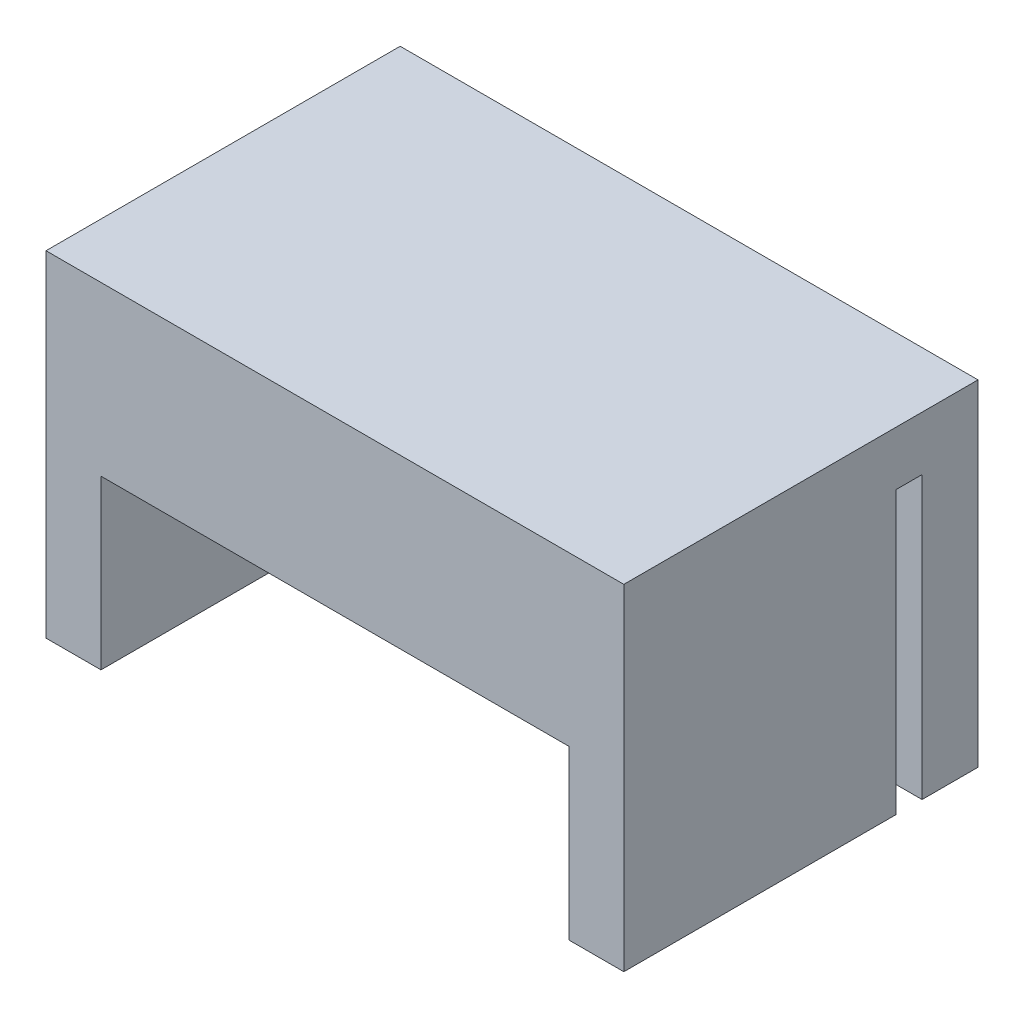
ISO-10303-21;
HEADER;
FILE_DESCRIPTION(('STEP AP214'),'2;1');
FILE_NAME('part.step','',(''),(''),'','','');
FILE_SCHEMA(('AUTOMOTIVE_DESIGN { 1 0 10303 214 1 1 1 1 }'));
ENDSEC;
DATA;
#1=APPLICATION_CONTEXT('core data for automotive mechanical design processes');
#2=APPLICATION_PROTOCOL_DEFINITION('international standard','automotive_design',2000,#1);
#3=PRODUCT_CONTEXT('',#1,'mechanical');
#4=PRODUCT('Part','Part','',(#3));
#5=PRODUCT_RELATED_PRODUCT_CATEGORY('part','',(#4));
#6=PRODUCT_DEFINITION_FORMATION('','',#4);
#7=PRODUCT_DEFINITION_CONTEXT('part definition',#1,'design');
#8=PRODUCT_DEFINITION('design','',#6,#7);
#9=PRODUCT_DEFINITION_SHAPE('','',#8);
#10=(LENGTH_UNIT() NAMED_UNIT(*) SI_UNIT(.MILLI.,.METRE.));
#11=(NAMED_UNIT(*) PLANE_ANGLE_UNIT() SI_UNIT($,.RADIAN.));
#12=(NAMED_UNIT(*) SI_UNIT($,.STERADIAN.) SOLID_ANGLE_UNIT());
#13=UNCERTAINTY_MEASURE_WITH_UNIT(LENGTH_MEASURE(1.E-05),#10,'distance_accuracy_value','');
#14=(GEOMETRIC_REPRESENTATION_CONTEXT(3) GLOBAL_UNCERTAINTY_ASSIGNED_CONTEXT((#13)) GLOBAL_UNIT_ASSIGNED_CONTEXT((#10,
#11,#12)) REPRESENTATION_CONTEXT('',''));
#15=CARTESIAN_POINT('',(0.,0.,0.));
#16=DIRECTION('',(0.,0.,1.));
#17=DIRECTION('',(1.,0.,0.));
#18=AXIS2_PLACEMENT_3D('',#15,#16,#17);
#19=CARTESIAN_POINT('',(-15.5,-9.,19.));
#20=DIRECTION('',(0.,1.,0.));
#21=DIRECTION('',(0.,0.,1.));
#22=AXIS2_PLACEMENT_3D('',#19,#20,#21);
#23=PLANE('',#22);
#24=DIRECTION('',(0.,0.,1.));
#25=VECTOR('',#24,1.);
#26=CARTESIAN_POINT('',(12.55,-9.,3.));
#27=LINE('',#26,#25);
#28=CARTESIAN_POINT('',(12.55,-9.,4.4));
#29=VERTEX_POINT('',#28);
#30=CARTESIAN_POINT('',(12.55,-9.,19.));
#31=VERTEX_POINT('',#30);
#32=EDGE_CURVE('E50',#29,#31,#27,.T.);
#33=ORIENTED_EDGE('',*,*,#32,.F.);
#34=DIRECTION('',(-1.,0.,0.));
#35=VECTOR('',#34,1.);
#36=CARTESIAN_POINT('',(-15.5,-9.,4.4));
#37=LINE('',#36,#35);
#38=CARTESIAN_POINT('',(15.5,-9.,4.4));
#39=VERTEX_POINT('',#38);
#40=EDGE_CURVE('E156',#39,#29,#37,.T.);
#41=ORIENTED_EDGE('',*,*,#40,.F.);
#42=DIRECTION('',(0.,0.,-1.));
#43=VECTOR('',#42,1.);
#44=CARTESIAN_POINT('',(15.5,-9.,19.));
#45=LINE('',#44,#43);
#46=CARTESIAN_POINT('',(15.5,-9.,19.));
#47=VERTEX_POINT('',#46);
#48=EDGE_CURVE('E207',#47,#39,#45,.T.);
#49=ORIENTED_EDGE('',*,*,#48,.F.);
#50=DIRECTION('',(1.,0.,0.));
#51=VECTOR('',#50,1.);
#52=CARTESIAN_POINT('',(-15.5,-9.,19.));
#53=LINE('',#52,#51);
#54=EDGE_CURVE('E58',#31,#47,#53,.T.);
#55=ORIENTED_EDGE('',*,*,#54,.F.);
#56=EDGE_LOOP('',(#33,#41,#49,#55));
#57=FACE_BOUND('',#56,.T.);
#58=ADVANCED_FACE('F34',(#57),#23,.F.);
#59=DIRECTION('',(0.,0.,-1.));
#60=VECTOR('',#59,1.);
#61=CARTESIAN_POINT('',(-15.5,-9.,19.));
#62=LINE('',#61,#60);
#63=CARTESIAN_POINT('',(-15.5,-9.,19.));
#64=VERTEX_POINT('',#63);
#65=CARTESIAN_POINT('',(-15.5,-9.,4.4));
#66=VERTEX_POINT('',#65);
#67=EDGE_CURVE('E210',#64,#66,#62,.T.);
#68=ORIENTED_EDGE('',*,*,#67,.T.);
#69=CARTESIAN_POINT('',(-12.55,-9.,4.4));
#70=VERTEX_POINT('',#69);
#71=EDGE_CURVE('E218',#70,#66,#37,.T.);
#72=ORIENTED_EDGE('',*,*,#71,.F.);
#73=DIRECTION('',(0.,0.,1.));
#74=VECTOR('',#73,1.);
#75=CARTESIAN_POINT('',(-12.55,-9.,3.));
#76=LINE('',#75,#74);
#77=CARTESIAN_POINT('',(-12.55,-9.,19.));
#78=VERTEX_POINT('',#77);
#79=EDGE_CURVE('E177',#70,#78,#76,.T.);
#80=ORIENTED_EDGE('',*,*,#79,.T.);
#81=EDGE_CURVE('E198',#64,#78,#53,.T.);
#82=ORIENTED_EDGE('',*,*,#81,.F.);
#83=EDGE_LOOP('',(#68,#72,#80,#82));
#84=FACE_BOUND('',#83,.T.);
#85=ADVANCED_FACE('F247',(#84),#23,.F.);
#86=CARTESIAN_POINT('',(15.5,-9.,19.));
#87=DIRECTION('',(-1.,0.,0.));
#88=DIRECTION('',(0.,0.,1.));
#89=AXIS2_PLACEMENT_3D('',#86,#87,#88);
#90=PLANE('',#89);
#91=ORIENTED_EDGE('',*,*,#48,.T.);
#92=DIRECTION('',(0.,-1.,0.));
#93=VECTOR('',#92,1.);
#94=CARTESIAN_POINT('',(15.5,6.1,4.4));
#95=LINE('',#94,#93);
#96=CARTESIAN_POINT('',(15.5,6.1,4.4));
#97=VERTEX_POINT('',#96);
#98=EDGE_CURVE('E162',#97,#39,#95,.T.);
#99=ORIENTED_EDGE('',*,*,#98,.F.);
#100=DIRECTION('',(0.,0.,1.));
#101=VECTOR('',#100,1.);
#102=CARTESIAN_POINT('',(15.5,6.1,4.4));
#103=LINE('',#102,#101);
#104=CARTESIAN_POINT('',(15.5,6.1,3.));
#105=VERTEX_POINT('',#104);
#106=EDGE_CURVE('E146',#105,#97,#103,.T.);
#107=ORIENTED_EDGE('',*,*,#106,.F.);
#108=DIRECTION('',(0.,-1.,0.));
#109=VECTOR('',#108,1.);
#110=CARTESIAN_POINT('',(15.5,6.1,3.));
#111=LINE('',#110,#109);
#112=CARTESIAN_POINT('',(15.5,-9.,3.));
#113=VERTEX_POINT('',#112);
#114=EDGE_CURVE('E143',#105,#113,#111,.T.);
#115=ORIENTED_EDGE('',*,*,#114,.T.);
#116=CARTESIAN_POINT('',(15.5,-9.,0.));
#117=VERTEX_POINT('',#116);
#118=EDGE_CURVE('E81',#113,#117,#45,.T.);
#119=ORIENTED_EDGE('',*,*,#118,.T.);
#120=DIRECTION('',(0.,1.,0.));
#121=VECTOR('',#120,1.);
#122=CARTESIAN_POINT('',(15.5,-9.,0.));
#123=LINE('',#122,#121);
#124=CARTESIAN_POINT('',(15.5,9.,0.));
#125=VERTEX_POINT('',#124);
#126=EDGE_CURVE('E187',#117,#125,#123,.T.);
#127=ORIENTED_EDGE('',*,*,#126,.T.);
#128=DIRECTION('',(0.,0.,-1.));
#129=VECTOR('',#128,1.);
#130=CARTESIAN_POINT('',(15.5,9.,19.));
#131=LINE('',#130,#129);
#132=CARTESIAN_POINT('',(15.5,9.,19.));
#133=VERTEX_POINT('',#132);
#134=EDGE_CURVE('E43',#133,#125,#131,.T.);
#135=ORIENTED_EDGE('',*,*,#134,.F.);
#136=DIRECTION('',(0.,1.,0.));
#137=VECTOR('',#136,1.);
#138=CARTESIAN_POINT('',(15.5,-9.,19.));
#139=LINE('',#138,#137);
#140=EDGE_CURVE('E192',#47,#133,#139,.T.);
#141=ORIENTED_EDGE('',*,*,#140,.F.);
#142=EDGE_LOOP('',(#91,#99,#107,#115,#119,#127,#135,#141));
#143=FACE_BOUND('',#142,.T.);
#144=ADVANCED_FACE('F36',(#143),#90,.F.);
#145=CARTESIAN_POINT('',(-15.5,9.,19.));
#146=DIRECTION('',(0.,-1.,0.));
#147=DIRECTION('',(0.,0.,-1.));
#148=AXIS2_PLACEMENT_3D('',#145,#146,#147);
#149=PLANE('',#148);
#150=DIRECTION('',(-1.,0.,0.));
#151=VECTOR('',#150,1.);
#152=CARTESIAN_POINT('',(-15.5,9.,0.));
#153=LINE('',#152,#151);
#154=CARTESIAN_POINT('',(-15.5,9.,0.));
#155=VERTEX_POINT('',#154);
#156=EDGE_CURVE('E202',#125,#155,#153,.T.);
#157=ORIENTED_EDGE('',*,*,#156,.T.);
#158=DIRECTION('',(0.,0.,-1.));
#159=VECTOR('',#158,1.);
#160=CARTESIAN_POINT('',(-15.5,9.,19.));
#161=LINE('',#160,#159);
#162=CARTESIAN_POINT('',(-15.5,9.,19.));
#163=VERTEX_POINT('',#162);
#164=EDGE_CURVE('E213',#163,#155,#161,.T.);
#165=ORIENTED_EDGE('',*,*,#164,.F.);
#166=DIRECTION('',(-1.,0.,0.));
#167=VECTOR('',#166,1.);
#168=CARTESIAN_POINT('',(-15.5,9.,19.));
#169=LINE('',#168,#167);
#170=EDGE_CURVE('E89',#133,#163,#169,.T.);
#171=ORIENTED_EDGE('',*,*,#170,.F.);
#172=ORIENTED_EDGE('',*,*,#134,.T.);
#173=EDGE_LOOP('',(#157,#165,#171,#172));
#174=FACE_BOUND('',#173,.T.);
#175=ADVANCED_FACE('F242',(#174),#149,.F.);
#176=CARTESIAN_POINT('',(-15.5,-9.,19.));
#177=DIRECTION('',(1.,0.,0.));
#178=DIRECTION('',(0.,0.,-1.));
#179=AXIS2_PLACEMENT_3D('',#176,#177,#178);
#180=PLANE('',#179);
#181=DIRECTION('',(0.,0.,-1.));
#182=VECTOR('',#181,1.);
#183=CARTESIAN_POINT('',(-15.5,6.1,4.4));
#184=LINE('',#183,#182);
#185=CARTESIAN_POINT('',(-15.5,6.1,4.4));
#186=VERTEX_POINT('',#185);
#187=CARTESIAN_POINT('',(-15.5,6.1,3.));
#188=VERTEX_POINT('',#187);
#189=EDGE_CURVE('E147',#186,#188,#184,.T.);
#190=ORIENTED_EDGE('',*,*,#189,.F.);
#191=DIRECTION('',(0.,-1.,0.));
#192=VECTOR('',#191,1.);
#193=CARTESIAN_POINT('',(-15.5,6.1,4.4));
#194=LINE('',#193,#192);
#195=EDGE_CURVE('E171',#186,#66,#194,.T.);
#196=ORIENTED_EDGE('',*,*,#195,.T.);
#197=ORIENTED_EDGE('',*,*,#67,.F.);
#198=DIRECTION('',(0.,-1.,0.));
#199=VECTOR('',#198,1.);
#200=CARTESIAN_POINT('',(-15.5,-9.,19.));
#201=LINE('',#200,#199);
#202=EDGE_CURVE('E196',#163,#64,#201,.T.);
#203=ORIENTED_EDGE('',*,*,#202,.F.);
#204=ORIENTED_EDGE('',*,*,#164,.T.);
#205=DIRECTION('',(0.,-1.,0.));
#206=VECTOR('',#205,1.);
#207=CARTESIAN_POINT('',(-15.5,-9.,0.));
#208=LINE('',#207,#206);
#209=CARTESIAN_POINT('',(-15.5,-9.,0.));
#210=VERTEX_POINT('',#209);
#211=EDGE_CURVE('E204',#155,#210,#208,.T.);
#212=ORIENTED_EDGE('',*,*,#211,.T.);
#213=CARTESIAN_POINT('',(-15.5,-9.,3.));
#214=VERTEX_POINT('',#213);
#215=EDGE_CURVE('E160',#214,#210,#62,.T.);
#216=ORIENTED_EDGE('',*,*,#215,.F.);
#217=DIRECTION('',(0.,-1.,0.));
#218=VECTOR('',#217,1.);
#219=CARTESIAN_POINT('',(-15.5,6.1,3.));
#220=LINE('',#219,#218);
#221=EDGE_CURVE('E141',#188,#214,#220,.T.);
#222=ORIENTED_EDGE('',*,*,#221,.F.);
#223=EDGE_LOOP('',(#190,#196,#197,#203,#204,#212,#216,#222));
#224=FACE_BOUND('',#223,.T.);
#225=ADVANCED_FACE('F158',(#224),#180,.F.);
#226=ORIENTED_EDGE('',*,*,#118,.F.);
#227=DIRECTION('',(1.,0.,0.));
#228=VECTOR('',#227,1.);
#229=CARTESIAN_POINT('',(-12.55,-9.,3.));
#230=LINE('',#229,#228);
#231=EDGE_CURVE('E175',#214,#113,#230,.T.);
#232=ORIENTED_EDGE('',*,*,#231,.F.);
#233=ORIENTED_EDGE('',*,*,#215,.T.);
#234=DIRECTION('',(1.,0.,0.));
#235=VECTOR('',#234,1.);
#236=CARTESIAN_POINT('',(-15.5,-9.,0.));
#237=LINE('',#236,#235);
#238=EDGE_CURVE('E194',#210,#117,#237,.T.);
#239=ORIENTED_EDGE('',*,*,#238,.T.);
#240=EDGE_LOOP('',(#226,#232,#233,#239));
#241=FACE_BOUND('',#240,.T.);
#242=ADVANCED_FACE('F270',(#241),#23,.F.);
#243=CARTESIAN_POINT('',(0.,0.,19.));
#244=DIRECTION('',(0.,0.,-1.));
#245=DIRECTION('',(-1.,0.,0.));
#246=AXIS2_PLACEMENT_3D('',#243,#244,#245);
#247=PLANE('',#246);
#248=ORIENTED_EDGE('',*,*,#81,.T.);
#249=DIRECTION('',(0.,-1.,0.));
#250=VECTOR('',#249,1.);
#251=CARTESIAN_POINT('',(-12.55,-9.,19.));
#252=LINE('',#251,#250);
#253=CARTESIAN_POINT('',(-12.55,0.,19.));
#254=VERTEX_POINT('',#253);
#255=EDGE_CURVE('E174',#254,#78,#252,.T.);
#256=ORIENTED_EDGE('',*,*,#255,.F.);
#257=DIRECTION('',(-1.,0.,0.));
#258=VECTOR('',#257,1.);
#259=CARTESIAN_POINT('',(-12.55,0.,19.));
#260=LINE('',#259,#258);
#261=CARTESIAN_POINT('',(12.55,0.,19.));
#262=VERTEX_POINT('',#261);
#263=EDGE_CURVE('E178',#262,#254,#260,.T.);
#264=ORIENTED_EDGE('',*,*,#263,.F.);
#265=DIRECTION('',(0.,1.,0.));
#266=VECTOR('',#265,1.);
#267=CARTESIAN_POINT('',(12.55,-9.,19.));
#268=LINE('',#267,#266);
#269=EDGE_CURVE('E181',#31,#262,#268,.T.);
#270=ORIENTED_EDGE('',*,*,#269,.F.);
#271=ORIENTED_EDGE('',*,*,#54,.T.);
#272=ORIENTED_EDGE('',*,*,#140,.T.);
#273=ORIENTED_EDGE('',*,*,#170,.T.);
#274=ORIENTED_EDGE('',*,*,#202,.T.);
#275=EDGE_LOOP('',(#248,#256,#264,#270,#271,#272,#273,#274));
#276=FACE_BOUND('',#275,.T.);
#277=ADVANCED_FACE('F239',(#276),#247,.F.);
#278=CARTESIAN_POINT('',(0.,0.,0.));
#279=DIRECTION('',(0.,0.,-1.));
#280=DIRECTION('',(-1.,0.,0.));
#281=AXIS2_PLACEMENT_3D('',#278,#279,#280);
#282=PLANE('',#281);
#283=CARTESIAN_POINT('',(-7.5,-4.35,0.));
#284=DIRECTION('',(0.,0.,-1.));
#285=DIRECTION('',(-1.,0.,0.));
#286=AXIS2_PLACEMENT_3D('',#283,#284,#285);
#287=CIRCLE('',#286,1.5);
#288=CARTESIAN_POINT('',(-9.,-4.35,0.));
#289=VERTEX_POINT('',#288);
#290=EDGE_CURVE('E228',#289,#289,#287,.T.);
#291=ORIENTED_EDGE('',*,*,#290,.F.);
#292=EDGE_LOOP('',(#291));
#293=FACE_BOUND('',#292,.T.);
#294=CARTESIAN_POINT('',(7.5,-4.35,0.));
#295=DIRECTION('',(0.,0.,-1.));
#296=DIRECTION('',(-1.,0.,0.));
#297=AXIS2_PLACEMENT_3D('',#294,#295,#296);
#298=CIRCLE('',#297,1.5);
#299=CARTESIAN_POINT('',(6.,-4.35,0.));
#300=VERTEX_POINT('',#299);
#301=EDGE_CURVE('E219',#300,#300,#298,.T.);
#302=ORIENTED_EDGE('',*,*,#301,.F.);
#303=EDGE_LOOP('',(#302));
#304=FACE_BOUND('',#303,.T.);
#305=ORIENTED_EDGE('',*,*,#126,.F.);
#306=ORIENTED_EDGE('',*,*,#238,.F.);
#307=ORIENTED_EDGE('',*,*,#211,.F.);
#308=ORIENTED_EDGE('',*,*,#156,.F.);
#309=EDGE_LOOP('',(#305,#306,#307,#308));
#310=FACE_BOUND('',#309,.T.);
#311=ADVANCED_FACE('F282',(#293,#304,#310),#282,.T.);
#312=CARTESIAN_POINT('',(-12.55,-9.,3.));
#313=DIRECTION('',(-1.,0.,0.));
#314=DIRECTION('',(0.,0.,1.));
#315=AXIS2_PLACEMENT_3D('',#312,#313,#314);
#316=PLANE('',#315);
#317=ORIENTED_EDGE('',*,*,#79,.F.);
#318=DIRECTION('',(0.,1.,0.));
#319=VECTOR('',#318,1.);
#320=CARTESIAN_POINT('',(-12.55,-9.,4.4));
#321=LINE('',#320,#319);
#322=CARTESIAN_POINT('',(-12.55,0.,4.4));
#323=VERTEX_POINT('',#322);
#324=EDGE_CURVE('E170',#70,#323,#321,.T.);
#325=ORIENTED_EDGE('',*,*,#324,.T.);
#326=DIRECTION('',(0.,0.,1.));
#327=VECTOR('',#326,1.);
#328=CARTESIAN_POINT('',(-12.55,0.,3.));
#329=LINE('',#328,#327);
#330=EDGE_CURVE('E185',#323,#254,#329,.T.);
#331=ORIENTED_EDGE('',*,*,#330,.T.);
#332=ORIENTED_EDGE('',*,*,#255,.T.);
#333=EDGE_LOOP('',(#317,#325,#331,#332));
#334=FACE_BOUND('',#333,.T.);
#335=ADVANCED_FACE('F252',(#334),#316,.F.);
#336=CARTESIAN_POINT('',(-12.55,0.,3.));
#337=DIRECTION('',(0.,1.,0.));
#338=DIRECTION('',(0.,0.,1.));
#339=AXIS2_PLACEMENT_3D('',#336,#337,#338);
#340=PLANE('',#339);
#341=ORIENTED_EDGE('',*,*,#330,.F.);
#342=DIRECTION('',(1.,0.,0.));
#343=VECTOR('',#342,1.);
#344=CARTESIAN_POINT('',(-12.55,0.,4.4));
#345=LINE('',#344,#343);
#346=CARTESIAN_POINT('',(12.55,0.,4.4));
#347=VERTEX_POINT('',#346);
#348=EDGE_CURVE('E167',#323,#347,#345,.T.);
#349=ORIENTED_EDGE('',*,*,#348,.T.);
#350=DIRECTION('',(0.,0.,1.));
#351=VECTOR('',#350,1.);
#352=CARTESIAN_POINT('',(12.55,0.,3.));
#353=LINE('',#352,#351);
#354=EDGE_CURVE('E188',#347,#262,#353,.T.);
#355=ORIENTED_EDGE('',*,*,#354,.T.);
#356=ORIENTED_EDGE('',*,*,#263,.T.);
#357=EDGE_LOOP('',(#341,#349,#355,#356));
#358=FACE_BOUND('',#357,.T.);
#359=ADVANCED_FACE('F255',(#358),#340,.F.);
#360=CARTESIAN_POINT('',(12.55,-9.,3.));
#361=DIRECTION('',(1.,0.,0.));
#362=DIRECTION('',(0.,1.,0.));
#363=AXIS2_PLACEMENT_3D('',#360,#361,#362);
#364=PLANE('',#363);
#365=ORIENTED_EDGE('',*,*,#354,.F.);
#366=DIRECTION('',(0.,-1.,0.));
#367=VECTOR('',#366,1.);
#368=CARTESIAN_POINT('',(12.55,-9.,4.4));
#369=LINE('',#368,#367);
#370=EDGE_CURVE('E11',#347,#29,#369,.T.);
#371=ORIENTED_EDGE('',*,*,#370,.T.);
#372=ORIENTED_EDGE('',*,*,#32,.T.);
#373=ORIENTED_EDGE('',*,*,#269,.T.);
#374=EDGE_LOOP('',(#365,#371,#372,#373));
#375=FACE_BOUND('',#374,.T.);
#376=ADVANCED_FACE('F257',(#375),#364,.F.);
#377=CARTESIAN_POINT('',(0.,0.,3.));
#378=DIRECTION('',(0.,0.,-1.));
#379=DIRECTION('',(-1.,0.,0.));
#380=AXIS2_PLACEMENT_3D('',#377,#378,#379);
#381=PLANE('',#380);
#382=CARTESIAN_POINT('',(-7.5,-4.35,3.));
#383=DIRECTION('',(0.,0.,-1.));
#384=DIRECTION('',(-1.,0.,0.));
#385=AXIS2_PLACEMENT_3D('',#382,#383,#384);
#386=CIRCLE('',#385,1.5);
#387=CARTESIAN_POINT('',(-9.,-4.35,3.));
#388=VERTEX_POINT('',#387);
#389=EDGE_CURVE('E38',#388,#388,#386,.T.);
#390=ORIENTED_EDGE('',*,*,#389,.T.);
#391=EDGE_LOOP('',(#390));
#392=FACE_BOUND('',#391,.T.);
#393=CARTESIAN_POINT('',(7.5,-4.35,3.));
#394=DIRECTION('',(0.,0.,-1.));
#395=DIRECTION('',(-1.,0.,0.));
#396=AXIS2_PLACEMENT_3D('',#393,#394,#395);
#397=CIRCLE('',#396,1.5);
#398=CARTESIAN_POINT('',(6.,-4.35,3.));
#399=VERTEX_POINT('',#398);
#400=EDGE_CURVE('E216',#399,#399,#397,.T.);
#401=ORIENTED_EDGE('',*,*,#400,.T.);
#402=EDGE_LOOP('',(#401));
#403=FACE_BOUND('',#402,.T.);
#404=ORIENTED_EDGE('',*,*,#221,.T.);
#405=ORIENTED_EDGE('',*,*,#231,.T.);
#406=ORIENTED_EDGE('',*,*,#114,.F.);
#407=DIRECTION('',(1.,0.,0.));
#408=VECTOR('',#407,1.);
#409=CARTESIAN_POINT('',(-15.5,6.1,3.));
#410=LINE('',#409,#408);
#411=EDGE_CURVE('E137',#188,#105,#410,.T.);
#412=ORIENTED_EDGE('',*,*,#411,.F.);
#413=EDGE_LOOP('',(#404,#405,#406,#412));
#414=FACE_BOUND('',#413,.T.);
#415=ADVANCED_FACE('F139',(#392,#403,#414),#381,.F.);
#416=CARTESIAN_POINT('',(-15.5,6.1,4.4));
#417=DIRECTION('',(0.,0.,1.));
#418=DIRECTION('',(1.,0.,0.));
#419=AXIS2_PLACEMENT_3D('',#416,#417,#418);
#420=PLANE('',#419);
#421=ORIENTED_EDGE('',*,*,#71,.T.);
#422=ORIENTED_EDGE('',*,*,#195,.F.);
#423=DIRECTION('',(-1.,0.,0.));
#424=VECTOR('',#423,1.);
#425=CARTESIAN_POINT('',(-15.5,6.1,4.4));
#426=LINE('',#425,#424);
#427=EDGE_CURVE('E153',#97,#186,#426,.T.);
#428=ORIENTED_EDGE('',*,*,#427,.F.);
#429=ORIENTED_EDGE('',*,*,#98,.T.);
#430=ORIENTED_EDGE('',*,*,#40,.T.);
#431=ORIENTED_EDGE('',*,*,#370,.F.);
#432=ORIENTED_EDGE('',*,*,#348,.F.);
#433=ORIENTED_EDGE('',*,*,#324,.F.);
#434=EDGE_LOOP('',(#421,#422,#428,#429,#430,#431,#432,#433));
#435=FACE_BOUND('',#434,.T.);
#436=ADVANCED_FACE('F235',(#435),#420,.F.);
#437=CARTESIAN_POINT('',(0.,6.1,0.));
#438=DIRECTION('',(0.,-1.,0.));
#439=DIRECTION('',(0.,0.,-1.));
#440=AXIS2_PLACEMENT_3D('',#437,#438,#439);
#441=PLANE('',#440);
#442=ORIENTED_EDGE('',*,*,#189,.T.);
#443=ORIENTED_EDGE('',*,*,#411,.T.);
#444=ORIENTED_EDGE('',*,*,#106,.T.);
#445=ORIENTED_EDGE('',*,*,#427,.T.);
#446=EDGE_LOOP('',(#442,#443,#444,#445));
#447=FACE_BOUND('',#446,.T.);
#448=ADVANCED_FACE('F151',(#447),#441,.T.);
#449=CARTESIAN_POINT('',(7.5,-4.35,19.));
#450=DIRECTION('',(0.,0.,-1.));
#451=DIRECTION('',(-1.,0.,0.));
#452=AXIS2_PLACEMENT_3D('',#449,#450,#451);
#453=CYLINDRICAL_SURFACE('',#452,1.5);
#454=ORIENTED_EDGE('',*,*,#301,.T.);
#455=EDGE_LOOP('',(#454));
#456=FACE_BOUND('',#455,.T.);
#457=ORIENTED_EDGE('',*,*,#400,.F.);
#458=EDGE_LOOP('',(#457));
#459=FACE_BOUND('',#458,.T.);
#460=ADVANCED_FACE('F299',(#456,#459),#453,.F.);
#461=CARTESIAN_POINT('',(-7.5,-4.35,19.));
#462=DIRECTION('',(0.,0.,-1.));
#463=DIRECTION('',(-1.,0.,0.));
#464=AXIS2_PLACEMENT_3D('',#461,#462,#463);
#465=CYLINDRICAL_SURFACE('',#464,1.5);
#466=ORIENTED_EDGE('',*,*,#290,.T.);
#467=EDGE_LOOP('',(#466));
#468=FACE_BOUND('',#467,.T.);
#469=ORIENTED_EDGE('',*,*,#389,.F.);
#470=EDGE_LOOP('',(#469));
#471=FACE_BOUND('',#470,.T.);
#472=ADVANCED_FACE('F296',(#468,#471),#465,.F.);
#473=CLOSED_SHELL('',(#58,#85,#144,#175,#225,#242,#277,#311,#335,#359,#376,#415,#436,#448,#460,#472));
#474=MANIFOLD_SOLID_BREP('B2',#473);
#475=ADVANCED_BREP_SHAPE_REPRESENTATION('',(#18,#474),#14);
#476=SHAPE_DEFINITION_REPRESENTATION(#9,#475);
ENDSEC;
END-ISO-10303-21;
